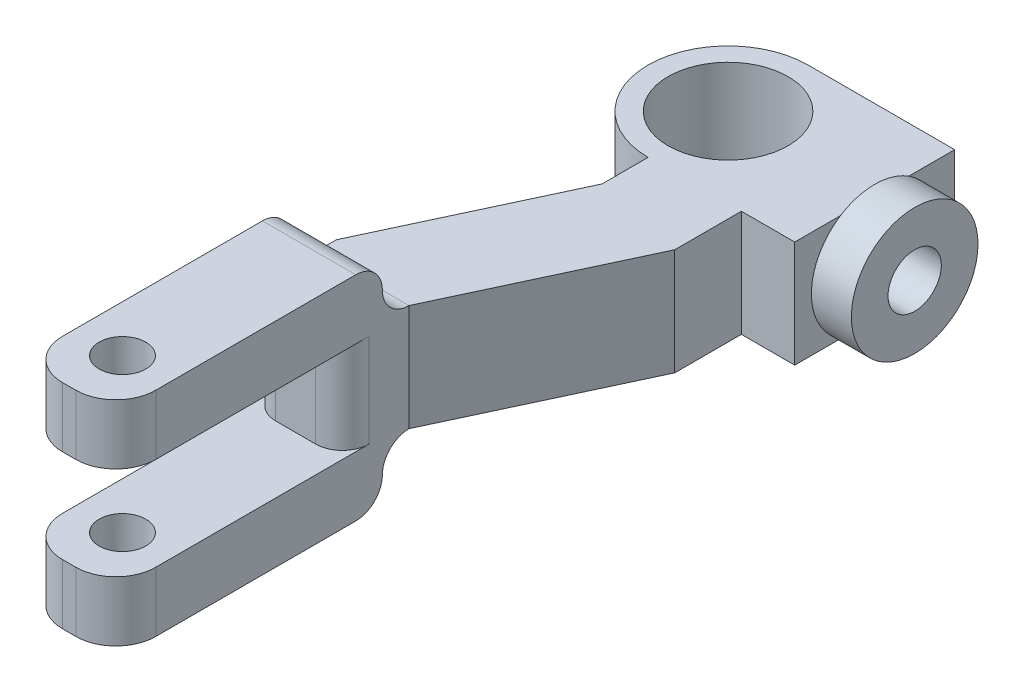
ISO-10303-21;
HEADER;
FILE_DESCRIPTION(('STEP AP214'),'2;1');
FILE_NAME('part.step','',(''),(''),'','','');
FILE_SCHEMA(('AUTOMOTIVE_DESIGN { 1 0 10303 214 1 1 1 1 }'));
ENDSEC;
DATA;
#1=APPLICATION_CONTEXT('core data for automotive mechanical design processes');
#2=APPLICATION_PROTOCOL_DEFINITION('international standard','automotive_design',2000,#1);
#3=PRODUCT_CONTEXT('',#1,'mechanical');
#4=PRODUCT('Part','Part','',(#3));
#5=PRODUCT_RELATED_PRODUCT_CATEGORY('part','',(#4));
#6=PRODUCT_DEFINITION_FORMATION('','',#4);
#7=PRODUCT_DEFINITION_CONTEXT('part definition',#1,'design');
#8=PRODUCT_DEFINITION('design','',#6,#7);
#9=PRODUCT_DEFINITION_SHAPE('','',#8);
#10=(LENGTH_UNIT() NAMED_UNIT(*) SI_UNIT(.MILLI.,.METRE.));
#11=(NAMED_UNIT(*) PLANE_ANGLE_UNIT() SI_UNIT($,.RADIAN.));
#12=(NAMED_UNIT(*) SI_UNIT($,.STERADIAN.) SOLID_ANGLE_UNIT());
#13=UNCERTAINTY_MEASURE_WITH_UNIT(LENGTH_MEASURE(1.E-05),#10,'distance_accuracy_value','');
#14=(GEOMETRIC_REPRESENTATION_CONTEXT(3) GLOBAL_UNCERTAINTY_ASSIGNED_CONTEXT((#13)) GLOBAL_UNIT_ASSIGNED_CONTEXT((#10,
#11,#12)) REPRESENTATION_CONTEXT('',''));
#15=CARTESIAN_POINT('',(0.,0.,0.));
#16=DIRECTION('',(0.,0.,1.));
#17=DIRECTION('',(1.,0.,0.));
#18=AXIS2_PLACEMENT_3D('',#15,#16,#17);
#19=CARTESIAN_POINT('',(0.,0.,46.5946168055497));
#20=DIRECTION('',(0.,0.,-1.));
#21=DIRECTION('',(-1.,0.,0.));
#22=AXIS2_PLACEMENT_3D('',#19,#20,#21);
#23=PLANE('',#22);
#24=DIRECTION('',(-1.,0.,0.));
#25=VECTOR('',#24,1.);
#26=CARTESIAN_POINT('',(0.660726073889497,12.,46.5946168055497));
#27=LINE('',#26,#25);
#28=CARTESIAN_POINT('',(-2.3392739261105,12.,46.5946168055497));
#29=VERTEX_POINT('',#28);
#30=CARTESIAN_POINT('',(-3.3392739261105,12.,46.5946168055497));
#31=VERTEX_POINT('',#30);
#32=EDGE_CURVE('E417',#29,#31,#27,.T.);
#33=ORIENTED_EDGE('',*,*,#32,.T.);
#34=DIRECTION('',(0.,-1.,0.));
#35=VECTOR('',#34,1.);
#36=CARTESIAN_POINT('',(-3.3392739261105,0.,46.5946168055497));
#37=LINE('',#36,#35);
#38=CARTESIAN_POINT('',(-3.3392739261105,7.5,46.5946168055497));
#39=VERTEX_POINT('',#38);
#40=EDGE_CURVE('E458',#31,#39,#37,.T.);
#41=ORIENTED_EDGE('',*,*,#40,.T.);
#42=DIRECTION('',(-1.,0.,0.));
#43=VECTOR('',#42,1.);
#44=CARTESIAN_POINT('',(-6.3392739261105,7.5,46.5946168055497));
#45=LINE('',#44,#43);
#46=CARTESIAN_POINT('',(-2.3392739261105,7.5,46.5946168055497));
#47=VERTEX_POINT('',#46);
#48=EDGE_CURVE('E573',#47,#39,#45,.T.);
#49=ORIENTED_EDGE('',*,*,#48,.F.);
#50=DIRECTION('',(0.,1.,0.));
#51=VECTOR('',#50,1.);
#52=CARTESIAN_POINT('',(-2.3392739261105,0.,46.5946168055497));
#53=LINE('',#52,#51);
#54=EDGE_CURVE('E454',#47,#29,#53,.T.);
#55=ORIENTED_EDGE('',*,*,#54,.T.);
#56=EDGE_LOOP('',(#33,#41,#49,#55));
#57=FACE_BOUND('',#56,.T.);
#58=ADVANCED_FACE('F43',(#57),#23,.F.);
#59=CARTESIAN_POINT('',(11.,8.,6.));
#60=DIRECTION('',(0.,0.,-1.));
#61=DIRECTION('',(-1.,0.,0.));
#62=AXIS2_PLACEMENT_3D('',#59,#60,#61);
#63=PLANE('',#62);
#64=DIRECTION('',(0.,-1.,0.));
#65=VECTOR('',#64,1.);
#66=CARTESIAN_POINT('',(7.,8.,6.));
#67=LINE('',#66,#65);
#68=CARTESIAN_POINT('',(7.,8.,6.));
#69=VERTEX_POINT('',#68);
#70=CARTESIAN_POINT('',(7.,0.,6.));
#71=VERTEX_POINT('',#70);
#72=EDGE_CURVE('E271',#69,#71,#67,.T.);
#73=ORIENTED_EDGE('',*,*,#72,.T.);
#74=DIRECTION('',(1.,0.,0.));
#75=VECTOR('',#74,1.);
#76=CARTESIAN_POINT('',(11.,0.,6.));
#77=LINE('',#76,#75);
#78=CARTESIAN_POINT('',(11.,0.,6.));
#79=VERTEX_POINT('',#78);
#80=EDGE_CURVE('E345',#71,#79,#77,.T.);
#81=ORIENTED_EDGE('',*,*,#80,.T.);
#82=DIRECTION('',(0.,-1.,0.));
#83=VECTOR('',#82,1.);
#84=CARTESIAN_POINT('',(11.,8.,6.));
#85=LINE('',#84,#83);
#86=CARTESIAN_POINT('',(11.,8.,6.));
#87=VERTEX_POINT('',#86);
#88=EDGE_CURVE('E363',#87,#79,#85,.T.);
#89=ORIENTED_EDGE('',*,*,#88,.F.);
#90=DIRECTION('',(1.,0.,0.));
#91=VECTOR('',#90,1.);
#92=CARTESIAN_POINT('',(11.,8.,6.));
#93=LINE('',#92,#91);
#94=EDGE_CURVE('E329',#69,#87,#93,.T.);
#95=ORIENTED_EDGE('',*,*,#94,.F.);
#96=EDGE_LOOP('',(#73,#81,#89,#95));
#97=FACE_BOUND('',#96,.T.);
#98=ADVANCED_FACE('F655',(#97),#63,.F.);
#99=CARTESIAN_POINT('',(11.,8.,-6.));
#100=DIRECTION('',(-1.,0.,0.));
#101=DIRECTION('',(0.,0.,1.));
#102=AXIS2_PLACEMENT_3D('',#99,#100,#101);
#103=PLANE('',#102);
#104=CARTESIAN_POINT('',(11.,4.,0.));
#105=DIRECTION('',(1.,0.,0.));
#106=DIRECTION('',(0.,0.,-1.));
#107=AXIS2_PLACEMENT_3D('',#104,#105,#106);
#108=CIRCLE('',#107,4.75);
#109=CARTESIAN_POINT('',(11.,8.,2.5617376914899));
#110=VERTEX_POINT('',#109);
#111=CARTESIAN_POINT('',(11.,0.,2.5617376914899));
#112=VERTEX_POINT('',#111);
#113=EDGE_CURVE('E375',#110,#112,#108,.T.);
#114=ORIENTED_EDGE('',*,*,#113,.F.);
#115=DIRECTION('',(0.,0.,-1.));
#116=VECTOR('',#115,1.);
#117=CARTESIAN_POINT('',(11.,8.,-6.));
#118=LINE('',#117,#116);
#119=EDGE_CURVE('E334',#87,#110,#118,.T.);
#120=ORIENTED_EDGE('',*,*,#119,.F.);
#121=ORIENTED_EDGE('',*,*,#88,.T.);
#122=DIRECTION('',(0.,0.,-1.));
#123=VECTOR('',#122,1.);
#124=CARTESIAN_POINT('',(11.,0.,-6.));
#125=LINE('',#124,#123);
#126=EDGE_CURVE('E349',#79,#112,#125,.T.);
#127=ORIENTED_EDGE('',*,*,#126,.T.);
#128=EDGE_LOOP('',(#114,#120,#121,#127));
#129=FACE_BOUND('',#128,.T.);
#130=ADVANCED_FACE('F660',(#129),#103,.F.);
#131=CARTESIAN_POINT('',(0.,8.,0.));
#132=DIRECTION('',(0.,1.,0.));
#133=DIRECTION('',(0.,0.,1.));
#134=AXIS2_PLACEMENT_3D('',#131,#132,#133);
#135=PLANE('',#134);
#136=DIRECTION('',(0.,0.,1.));
#137=VECTOR('',#136,1.);
#138=CARTESIAN_POINT('',(-6.3392739261105,8.,23.0427541670492));
#139=LINE('',#138,#137);
#140=CARTESIAN_POINT('',(-6.3392739261105,8.,23.0427541670492));
#141=VERTEX_POINT('',#140);
#142=CARTESIAN_POINT('',(-6.3392739261105,8.,24.5946168055497));
#143=VERTEX_POINT('',#142);
#144=EDGE_CURVE('E258',#141,#143,#139,.T.);
#145=ORIENTED_EDGE('',*,*,#144,.T.);
#146=DIRECTION('',(1.,0.,0.));
#147=VECTOR('',#146,1.);
#148=CARTESIAN_POINT('',(0.660726073889498,8.,24.5946168055497));
#149=LINE('',#148,#147);
#150=CARTESIAN_POINT('',(0.660726073889498,8.,24.5946168055497));
#151=VERTEX_POINT('',#150);
#152=EDGE_CURVE('E392',#143,#151,#149,.T.);
#153=ORIENTED_EDGE('',*,*,#152,.T.);
#154=DIRECTION('',(0.4226182617407,0.,-0.90630778703665));
#155=VECTOR('',#154,1.);
#156=CARTESIAN_POINT('',(0.660726073889498,8.,24.5946168055497));
#157=LINE('',#156,#155);
#158=CARTESIAN_POINT('',(7.,8.,11.));
#159=VERTEX_POINT('',#158);
#160=EDGE_CURVE('E261',#151,#159,#157,.T.);
#161=ORIENTED_EDGE('',*,*,#160,.T.);
#162=DIRECTION('',(0.,0.,-1.));
#163=VECTOR('',#162,1.);
#164=CARTESIAN_POINT('',(7.,8.,11.));
#165=LINE('',#164,#163);
#166=EDGE_CURVE('E267',#159,#69,#165,.T.);
#167=ORIENTED_EDGE('',*,*,#166,.T.);
#168=ORIENTED_EDGE('',*,*,#94,.T.);
#169=ORIENTED_EDGE('',*,*,#119,.T.);
#170=CARTESIAN_POINT('',(11.,8.,-2.5617376914899));
#171=VERTEX_POINT('',#170);
#172=EDGE_CURVE('E339',#110,#171,#118,.T.);
#173=ORIENTED_EDGE('',*,*,#172,.T.);
#174=CARTESIAN_POINT('',(11.,8.,-6.));
#175=VERTEX_POINT('',#174);
#176=EDGE_CURVE('E333',#171,#175,#118,.T.);
#177=ORIENTED_EDGE('',*,*,#176,.T.);
#178=DIRECTION('',(-1.,0.,0.));
#179=VECTOR('',#178,1.);
#180=CARTESIAN_POINT('',(0.,8.,-6.));
#181=LINE('',#180,#179);
#182=CARTESIAN_POINT('',(0.,8.,-6.));
#183=VERTEX_POINT('',#182);
#184=EDGE_CURVE('E338',#175,#183,#181,.T.);
#185=ORIENTED_EDGE('',*,*,#184,.T.);
#186=CARTESIAN_POINT('',(0.,8.,0.));
#187=DIRECTION('',(0.,1.,0.));
#188=DIRECTION('',(0.,0.,1.));
#189=AXIS2_PLACEMENT_3D('',#186,#187,#188);
#190=CIRCLE('',#189,6.);
#191=CARTESIAN_POINT('',(0.,8.,6.));
#192=VERTEX_POINT('',#191);
#193=EDGE_CURVE('E236',#183,#192,#190,.T.);
#194=ORIENTED_EDGE('',*,*,#193,.T.);
#195=DIRECTION('',(0.,0.,1.));
#196=VECTOR('',#195,1.);
#197=CARTESIAN_POINT('',(0.,8.,6.));
#198=LINE('',#197,#196);
#199=CARTESIAN_POINT('',(0.,8.,9.44813736149942));
#200=VERTEX_POINT('',#199);
#201=EDGE_CURVE('E227',#192,#200,#198,.T.);
#202=ORIENTED_EDGE('',*,*,#201,.T.);
#203=DIRECTION('',(-0.4226182617407,0.,0.90630778703665));
#204=VECTOR('',#203,1.);
#205=CARTESIAN_POINT('',(0.,8.,9.44813736149942));
#206=LINE('',#205,#204);
#207=EDGE_CURVE('E233',#200,#141,#206,.T.);
#208=ORIENTED_EDGE('',*,*,#207,.T.);
#209=EDGE_LOOP('',(#145,#153,#161,#167,#168,#169,#173,#177,#185,#194,#202,#208));
#210=FACE_BOUND('',#209,.T.);
#211=CARTESIAN_POINT('',(0.,8.,0.));
#212=DIRECTION('',(0.,1.,0.));
#213=DIRECTION('',(0.,0.,1.));
#214=AXIS2_PLACEMENT_3D('',#211,#212,#213);
#215=CIRCLE('',#214,4.5);
#216=CARTESIAN_POINT('',(0.,8.,4.5));
#217=VERTEX_POINT('',#216);
#218=EDGE_CURVE('E319',#217,#217,#215,.T.);
#219=ORIENTED_EDGE('',*,*,#218,.F.);
#220=EDGE_LOOP('',(#219));
#221=FACE_BOUND('',#220,.T.);
#222=ADVANCED_FACE('F230',(#210,#221),#135,.T.);
#223=CARTESIAN_POINT('',(0.,0.,0.));
#224=DIRECTION('',(0.,1.,0.));
#225=DIRECTION('',(0.,0.,1.));
#226=AXIS2_PLACEMENT_3D('',#223,#224,#225);
#227=PLANE('',#226);
#228=DIRECTION('',(0.4226182617407,0.,-0.90630778703665));
#229=VECTOR('',#228,1.);
#230=CARTESIAN_POINT('',(0.660726073889498,0.,24.5946168055497));
#231=LINE('',#230,#229);
#232=CARTESIAN_POINT('',(0.660726073889498,0.,24.5946168055497));
#233=VERTEX_POINT('',#232);
#234=CARTESIAN_POINT('',(7.,0.,11.));
#235=VERTEX_POINT('',#234);
#236=EDGE_CURVE('E282',#233,#235,#231,.T.);
#237=ORIENTED_EDGE('',*,*,#236,.F.);
#238=DIRECTION('',(1.,0.,0.));
#239=VECTOR('',#238,1.);
#240=CARTESIAN_POINT('',(0.,0.,24.5946168055497));
#241=LINE('',#240,#239);
#242=CARTESIAN_POINT('',(-6.3392739261105,0.,24.5946168055497));
#243=VERTEX_POINT('',#242);
#244=EDGE_CURVE('E389',#233,#243,#241,.F.);
#245=ORIENTED_EDGE('',*,*,#244,.T.);
#246=DIRECTION('',(0.,0.,1.));
#247=VECTOR('',#246,1.);
#248=CARTESIAN_POINT('',(-6.3392739261105,0.,23.0427541670492));
#249=LINE('',#248,#247);
#250=CARTESIAN_POINT('',(-6.3392739261105,0.,23.0427541670492));
#251=VERTEX_POINT('',#250);
#252=EDGE_CURVE('E278',#251,#243,#249,.T.);
#253=ORIENTED_EDGE('',*,*,#252,.F.);
#254=DIRECTION('',(-0.4226182617407,0.,0.90630778703665));
#255=VECTOR('',#254,1.);
#256=CARTESIAN_POINT('',(0.,0.,9.44813736149942));
#257=LINE('',#256,#255);
#258=CARTESIAN_POINT('',(0.,0.,9.44813736149942));
#259=VERTEX_POINT('',#258);
#260=EDGE_CURVE('E274',#259,#251,#257,.T.);
#261=ORIENTED_EDGE('',*,*,#260,.F.);
#262=DIRECTION('',(0.,0.,1.));
#263=VECTOR('',#262,1.);
#264=CARTESIAN_POINT('',(0.,0.,6.));
#265=LINE('',#264,#263);
#266=CARTESIAN_POINT('',(0.,0.,6.));
#267=VERTEX_POINT('',#266);
#268=EDGE_CURVE('E247',#267,#259,#265,.T.);
#269=ORIENTED_EDGE('',*,*,#268,.F.);
#270=CARTESIAN_POINT('',(0.,0.,0.));
#271=DIRECTION('',(0.,1.,0.));
#272=DIRECTION('',(0.,0.,1.));
#273=AXIS2_PLACEMENT_3D('',#270,#271,#272);
#274=CIRCLE('',#273,6.);
#275=CARTESIAN_POINT('',(0.,0.,-6.));
#276=VERTEX_POINT('',#275);
#277=EDGE_CURVE('E323',#276,#267,#274,.T.);
#278=ORIENTED_EDGE('',*,*,#277,.F.);
#279=DIRECTION('',(-1.,0.,0.));
#280=VECTOR('',#279,1.);
#281=CARTESIAN_POINT('',(0.,0.,-6.));
#282=LINE('',#281,#280);
#283=CARTESIAN_POINT('',(11.,0.,-6.));
#284=VERTEX_POINT('',#283);
#285=EDGE_CURVE('E330',#284,#276,#282,.T.);
#286=ORIENTED_EDGE('',*,*,#285,.F.);
#287=CARTESIAN_POINT('',(11.,0.,-2.5617376914899));
#288=VERTEX_POINT('',#287);
#289=EDGE_CURVE('E348',#288,#284,#125,.T.);
#290=ORIENTED_EDGE('',*,*,#289,.F.);
#291=EDGE_CURVE('E353',#112,#288,#125,.T.);
#292=ORIENTED_EDGE('',*,*,#291,.F.);
#293=ORIENTED_EDGE('',*,*,#126,.F.);
#294=ORIENTED_EDGE('',*,*,#80,.F.);
#295=DIRECTION('',(0.,0.,-1.));
#296=VECTOR('',#295,1.);
#297=CARTESIAN_POINT('',(7.,0.,11.));
#298=LINE('',#297,#296);
#299=EDGE_CURVE('E241',#235,#71,#298,.T.);
#300=ORIENTED_EDGE('',*,*,#299,.F.);
#301=EDGE_LOOP('',(#237,#245,#253,#261,#269,#278,#286,#290,#292,#293,#294,#300));
#302=FACE_BOUND('',#301,.T.);
#303=CARTESIAN_POINT('',(0.,0.,0.));
#304=DIRECTION('',(0.,1.,0.));
#305=DIRECTION('',(0.,0.,1.));
#306=AXIS2_PLACEMENT_3D('',#303,#304,#305);
#307=CIRCLE('',#306,4.5);
#308=CARTESIAN_POINT('',(0.,0.,4.5));
#309=VERTEX_POINT('',#308);
#310=EDGE_CURVE('E313',#309,#309,#307,.T.);
#311=ORIENTED_EDGE('',*,*,#310,.T.);
#312=EDGE_LOOP('',(#311));
#313=FACE_BOUND('',#312,.T.);
#314=ADVANCED_FACE('F638',(#302,#313),#227,.F.);
#315=CARTESIAN_POINT('',(0.,8.,0.));
#316=DIRECTION('',(0.,-1.,0.));
#317=DIRECTION('',(0.,0.,-1.));
#318=AXIS2_PLACEMENT_3D('',#315,#316,#317);
#319=CYLINDRICAL_SURFACE('',#318,6.);
#320=ORIENTED_EDGE('',*,*,#277,.T.);
#321=DIRECTION('',(0.,-1.,0.));
#322=VECTOR('',#321,1.);
#323=CARTESIAN_POINT('',(0.,8.,6.));
#324=LINE('',#323,#322);
#325=EDGE_CURVE('E367',#192,#267,#324,.T.);
#326=ORIENTED_EDGE('',*,*,#325,.F.);
#327=ORIENTED_EDGE('',*,*,#193,.F.);
#328=DIRECTION('',(0.,-1.,0.));
#329=VECTOR('',#328,1.);
#330=CARTESIAN_POINT('',(0.,8.,-6.));
#331=LINE('',#330,#329);
#332=EDGE_CURVE('E342',#183,#276,#331,.T.);
#333=ORIENTED_EDGE('',*,*,#332,.T.);
#334=EDGE_LOOP('',(#320,#326,#327,#333));
#335=FACE_BOUND('',#334,.T.);
#336=ADVANCED_FACE('F721',(#335),#319,.T.);
#337=EDGE_CURVE('E318',#288,#171,#108,.T.);
#338=ORIENTED_EDGE('',*,*,#337,.F.);
#339=ORIENTED_EDGE('',*,*,#289,.T.);
#340=DIRECTION('',(0.,-1.,0.));
#341=VECTOR('',#340,1.);
#342=CARTESIAN_POINT('',(11.,8.,-6.));
#343=LINE('',#342,#341);
#344=EDGE_CURVE('E359',#175,#284,#343,.T.);
#345=ORIENTED_EDGE('',*,*,#344,.F.);
#346=ORIENTED_EDGE('',*,*,#176,.F.);
#347=EDGE_LOOP('',(#338,#339,#345,#346));
#348=FACE_BOUND('',#347,.T.);
#349=ADVANCED_FACE('F724',(#348),#103,.F.);
#350=CARTESIAN_POINT('',(0.,8.,-6.));
#351=DIRECTION('',(0.,0.,1.));
#352=DIRECTION('',(1.,0.,0.));
#353=AXIS2_PLACEMENT_3D('',#350,#351,#352);
#354=PLANE('',#353);
#355=ORIENTED_EDGE('',*,*,#285,.T.);
#356=ORIENTED_EDGE('',*,*,#332,.F.);
#357=ORIENTED_EDGE('',*,*,#184,.F.);
#358=ORIENTED_EDGE('',*,*,#344,.T.);
#359=EDGE_LOOP('',(#355,#356,#357,#358));
#360=FACE_BOUND('',#359,.T.);
#361=ADVANCED_FACE('F715',(#360),#354,.F.);
#362=CARTESIAN_POINT('',(0.,8.,0.));
#363=DIRECTION('',(0.,-1.,0.));
#364=DIRECTION('',(0.,0.,-1.));
#365=AXIS2_PLACEMENT_3D('',#362,#363,#364);
#366=CYLINDRICAL_SURFACE('',#365,4.5);
#367=ORIENTED_EDGE('',*,*,#218,.T.);
#368=EDGE_LOOP('',(#367));
#369=FACE_BOUND('',#368,.T.);
#370=ORIENTED_EDGE('',*,*,#310,.F.);
#371=EDGE_LOOP('',(#370));
#372=FACE_BOUND('',#371,.T.);
#373=ADVANCED_FACE('F712',(#369,#372),#366,.F.);
#374=CARTESIAN_POINT('',(11.,4.,0.));
#375=DIRECTION('',(1.,0.,0.));
#376=DIRECTION('',(0.,0.,-1.));
#377=AXIS2_PLACEMENT_3D('',#374,#375,#376);
#378=PLANE('',#377);
#379=EDGE_CURVE('E305',#112,#288,#108,.T.);
#380=ORIENTED_EDGE('',*,*,#379,.F.);
#381=ORIENTED_EDGE('',*,*,#291,.T.);
#382=EDGE_LOOP('',(#380,#381));
#383=FACE_BOUND('',#382,.T.);
#384=ADVANCED_FACE('F708',(#383),#378,.F.);
#385=CARTESIAN_POINT('',(14.,4.,0.));
#386=DIRECTION('',(-1.,0.,0.));
#387=DIRECTION('',(0.,0.,1.));
#388=AXIS2_PLACEMENT_3D('',#385,#386,#387);
#389=CYLINDRICAL_SURFACE('',#388,4.75);
#390=CARTESIAN_POINT('',(14.,4.,0.));
#391=DIRECTION('',(1.,0.,0.));
#392=DIRECTION('',(0.,0.,-1.));
#393=AXIS2_PLACEMENT_3D('',#390,#391,#392);
#394=CIRCLE('',#393,4.75);
#395=CARTESIAN_POINT('',(14.,4.,-4.75));
#396=VERTEX_POINT('',#395);
#397=EDGE_CURVE('E309',#396,#396,#394,.T.);
#398=ORIENTED_EDGE('',*,*,#397,.F.);
#399=EDGE_LOOP('',(#398));
#400=FACE_BOUND('',#399,.T.);
#401=EDGE_CURVE('E314',#171,#110,#108,.T.);
#402=ORIENTED_EDGE('',*,*,#401,.T.);
#403=ORIENTED_EDGE('',*,*,#113,.T.);
#404=ORIENTED_EDGE('',*,*,#379,.T.);
#405=ORIENTED_EDGE('',*,*,#337,.T.);
#406=EDGE_LOOP('',(#402,#403,#404,#405));
#407=FACE_BOUND('',#406,.T.);
#408=ADVANCED_FACE('F703',(#400,#407),#389,.T.);
#409=CARTESIAN_POINT('',(14.,4.,0.));
#410=DIRECTION('',(1.,0.,0.));
#411=DIRECTION('',(0.,0.,-1.));
#412=AXIS2_PLACEMENT_3D('',#409,#410,#411);
#413=PLANE('',#412);
#414=CARTESIAN_POINT('',(14.,4.,0.));
#415=DIRECTION('',(1.,0.,0.));
#416=DIRECTION('',(0.,0.,-1.));
#417=AXIS2_PLACEMENT_3D('',#414,#415,#416);
#418=CIRCLE('',#417,2.);
#419=CARTESIAN_POINT('',(14.,4.,-2.));
#420=VERTEX_POINT('',#419);
#421=EDGE_CURVE('E251',#420,#420,#418,.T.);
#422=ORIENTED_EDGE('',*,*,#421,.F.);
#423=EDGE_LOOP('',(#422));
#424=FACE_BOUND('',#423,.T.);
#425=ORIENTED_EDGE('',*,*,#397,.T.);
#426=EDGE_LOOP('',(#425));
#427=FACE_BOUND('',#426,.T.);
#428=ADVANCED_FACE('F700',(#424,#427),#413,.T.);
#429=ORIENTED_EDGE('',*,*,#172,.F.);
#430=ORIENTED_EDGE('',*,*,#401,.F.);
#431=EDGE_LOOP('',(#429,#430));
#432=FACE_BOUND('',#431,.T.);
#433=ADVANCED_FACE('F698',(#432),#378,.F.);
#434=CARTESIAN_POINT('',(9.,4.,0.));
#435=DIRECTION('',(1.,0.,0.));
#436=DIRECTION('',(0.,0.,-1.));
#437=AXIS2_PLACEMENT_3D('',#434,#435,#436);
#438=CYLINDRICAL_SURFACE('',#437,2.);
#439=CARTESIAN_POINT('',(9.,4.,0.));
#440=DIRECTION('',(1.,0.,0.));
#441=DIRECTION('',(0.,0.,-1.));
#442=AXIS2_PLACEMENT_3D('',#439,#440,#441);
#443=CIRCLE('',#442,2.);
#444=CARTESIAN_POINT('',(9.,4.,-2.));
#445=VERTEX_POINT('',#444);
#446=EDGE_CURVE('E301',#445,#445,#443,.T.);
#447=ORIENTED_EDGE('',*,*,#446,.F.);
#448=EDGE_LOOP('',(#447));
#449=FACE_BOUND('',#448,.T.);
#450=ORIENTED_EDGE('',*,*,#421,.T.);
#451=EDGE_LOOP('',(#450));
#452=FACE_BOUND('',#451,.T.);
#453=ADVANCED_FACE('F694',(#449,#452),#438,.F.);
#454=CARTESIAN_POINT('',(9.,4.,0.));
#455=DIRECTION('',(1.,0.,0.));
#456=DIRECTION('',(0.,0.,-1.));
#457=AXIS2_PLACEMENT_3D('',#454,#455,#456);
#458=PLANE('',#457);
#459=ORIENTED_EDGE('',*,*,#446,.T.);
#460=EDGE_LOOP('',(#459));
#461=FACE_BOUND('',#460,.T.);
#462=ADVANCED_FACE('F691',(#461),#458,.T.);
#463=CARTESIAN_POINT('',(0.,8.,6.));
#464=DIRECTION('',(1.,0.,0.));
#465=DIRECTION('',(0.,0.,-1.));
#466=AXIS2_PLACEMENT_3D('',#463,#464,#465);
#467=PLANE('',#466);
#468=ORIENTED_EDGE('',*,*,#268,.T.);
#469=DIRECTION('',(0.,-1.,0.));
#470=VECTOR('',#469,1.);
#471=CARTESIAN_POINT('',(0.,8.,9.44813736149942));
#472=LINE('',#471,#470);
#473=EDGE_CURVE('E244',#200,#259,#472,.T.);
#474=ORIENTED_EDGE('',*,*,#473,.F.);
#475=ORIENTED_EDGE('',*,*,#201,.F.);
#476=ORIENTED_EDGE('',*,*,#325,.T.);
#477=EDGE_LOOP('',(#468,#474,#475,#476));
#478=FACE_BOUND('',#477,.T.);
#479=ADVANCED_FACE('F245',(#478),#467,.F.);
#480=CARTESIAN_POINT('',(0.,8.,9.44813736149942));
#481=DIRECTION('',(0.90630778703665,0.,0.4226182617407));
#482=DIRECTION('',(0.4226182617407,0.,-0.90630778703665));
#483=AXIS2_PLACEMENT_3D('',#480,#481,#482);
#484=PLANE('',#483);
#485=ORIENTED_EDGE('',*,*,#260,.T.);
#486=DIRECTION('',(0.,-1.,0.));
#487=VECTOR('',#486,1.);
#488=CARTESIAN_POINT('',(-6.3392739261105,8.,23.0427541670492));
#489=LINE('',#488,#487);
#490=EDGE_CURVE('E252',#141,#251,#489,.T.);
#491=ORIENTED_EDGE('',*,*,#490,.F.);
#492=ORIENTED_EDGE('',*,*,#207,.F.);
#493=ORIENTED_EDGE('',*,*,#473,.T.);
#494=EDGE_LOOP('',(#485,#491,#492,#493));
#495=FACE_BOUND('',#494,.T.);
#496=ADVANCED_FACE('F254',(#495),#484,.F.);
#497=CARTESIAN_POINT('',(-6.3392739261105,8.,23.0427541670492));
#498=DIRECTION('',(1.,0.,0.));
#499=DIRECTION('',(0.,0.,-1.));
#500=AXIS2_PLACEMENT_3D('',#497,#498,#499);
#501=PLANE('',#500);
#502=DIRECTION('',(0.,0.,1.));
#503=VECTOR('',#502,1.);
#504=CARTESIAN_POINT('',(-6.3392739261105,0.499999999999998,29.5946168055497));
#505=LINE('',#504,#503);
#506=CARTESIAN_POINT('',(-6.3392739261105,0.499999999999998,27.5946168055497));
#507=VERTEX_POINT('',#506);
#508=CARTESIAN_POINT('',(-6.3392739261105,0.499999999999998,43.5946168055497));
#509=VERTEX_POINT('',#508);
#510=EDGE_CURVE('E517',#507,#509,#505,.T.);
#511=ORIENTED_EDGE('',*,*,#510,.F.);
#512=DIRECTION('',(0.,-1.,0.));
#513=VECTOR('',#512,1.);
#514=CARTESIAN_POINT('',(-6.3392739261105,7.5,27.5946168055497));
#515=LINE('',#514,#513);
#516=CARTESIAN_POINT('',(-6.3392739261105,7.5,27.5946168055497));
#517=VERTEX_POINT('',#516);
#518=EDGE_CURVE('E488',#507,#517,#515,.F.);
#519=ORIENTED_EDGE('',*,*,#518,.T.);
#520=DIRECTION('',(0.,0.,1.));
#521=VECTOR('',#520,1.);
#522=CARTESIAN_POINT('',(-6.3392739261105,7.5,29.5946168055497));
#523=LINE('',#522,#521);
#524=CARTESIAN_POINT('',(-6.3392739261105,7.5,43.5946168055497));
#525=VERTEX_POINT('',#524);
#526=EDGE_CURVE('E422',#517,#525,#523,.T.);
#527=ORIENTED_EDGE('',*,*,#526,.T.);
#528=DIRECTION('',(0.,-1.,0.));
#529=VECTOR('',#528,1.);
#530=CARTESIAN_POINT('',(-6.3392739261105,8.,43.5946168055497));
#531=LINE('',#530,#529);
#532=CARTESIAN_POINT('',(-6.3392739261105,12.,43.5946168055497));
#533=VERTEX_POINT('',#532);
#534=EDGE_CURVE('E448',#525,#533,#531,.F.);
#535=ORIENTED_EDGE('',*,*,#534,.T.);
#536=DIRECTION('',(0.,0.,-1.));
#537=VECTOR('',#536,1.);
#538=CARTESIAN_POINT('',(-6.3392739261105,12.,46.5946168055497));
#539=LINE('',#538,#537);
#540=CARTESIAN_POINT('',(-6.3392739261105,12.,28.5946168055497));
#541=VERTEX_POINT('',#540);
#542=EDGE_CURVE('E546',#533,#541,#539,.T.);
#543=ORIENTED_EDGE('',*,*,#542,.T.);
#544=CARTESIAN_POINT('',(-6.3392739261105,10.,28.5946168055497));
#545=DIRECTION('',(1.,0.,0.));
#546=DIRECTION('',(0.,0.,-1.));
#547=AXIS2_PLACEMENT_3D('',#544,#545,#546);
#548=CIRCLE('',#547,2.);
#549=CARTESIAN_POINT('',(-6.3392739261105,10.,26.5946168055497));
#550=VERTEX_POINT('',#549);
#551=EDGE_CURVE('E382',#541,#550,#548,.F.);
#552=ORIENTED_EDGE('',*,*,#551,.T.);
#553=CARTESIAN_POINT('',(-6.3392739261105,10.,24.5946168055497));
#554=DIRECTION('',(1.,0.,0.));
#555=DIRECTION('',(0.,0.,-1.));
#556=AXIS2_PLACEMENT_3D('',#553,#554,#555);
#557=CIRCLE('',#556,2.);
#558=EDGE_CURVE('E409',#550,#143,#557,.T.);
#559=ORIENTED_EDGE('',*,*,#558,.T.);
#560=ORIENTED_EDGE('',*,*,#144,.F.);
#561=ORIENTED_EDGE('',*,*,#490,.T.);
#562=ORIENTED_EDGE('',*,*,#252,.T.);
#563=CARTESIAN_POINT('',(-6.3392739261105,-2.,24.5946168055497));
#564=DIRECTION('',(1.,0.,0.));
#565=DIRECTION('',(0.,0.,-1.));
#566=AXIS2_PLACEMENT_3D('',#563,#564,#565);
#567=CIRCLE('',#566,2.);
#568=CARTESIAN_POINT('',(-6.3392739261105,-2.,26.5946168055497));
#569=VERTEX_POINT('',#568);
#570=EDGE_CURVE('E403',#243,#569,#567,.T.);
#571=ORIENTED_EDGE('',*,*,#570,.T.);
#572=CARTESIAN_POINT('',(-6.3392739261105,-2.,28.5946168055497));
#573=DIRECTION('',(1.,0.,0.));
#574=DIRECTION('',(0.,0.,-1.));
#575=AXIS2_PLACEMENT_3D('',#572,#573,#574);
#576=CIRCLE('',#575,2.);
#577=CARTESIAN_POINT('',(-6.3392739261105,-4.,28.5946168055497));
#578=VERTEX_POINT('',#577);
#579=EDGE_CURVE('E385',#569,#578,#576,.F.);
#580=ORIENTED_EDGE('',*,*,#579,.T.);
#581=DIRECTION('',(0.,0.,-1.));
#582=VECTOR('',#581,1.);
#583=CARTESIAN_POINT('',(-6.3392739261105,-4.,46.5946168055497));
#584=LINE('',#583,#582);
#585=CARTESIAN_POINT('',(-6.3392739261105,-4.,43.5946168055497));
#586=VERTEX_POINT('',#585);
#587=EDGE_CURVE('E538',#586,#578,#584,.T.);
#588=ORIENTED_EDGE('',*,*,#587,.F.);
#589=DIRECTION('',(0.,-1.,0.));
#590=VECTOR('',#589,1.);
#591=CARTESIAN_POINT('',(-6.3392739261105,8.,43.5946168055497));
#592=LINE('',#591,#590);
#593=EDGE_CURVE('E451',#586,#509,#592,.F.);
#594=ORIENTED_EDGE('',*,*,#593,.T.);
#595=EDGE_LOOP('',(#511,#519,#527,#535,#543,#552,#559,#560,#561,#562,#571,#580,#588,#594));
#596=FACE_BOUND('',#595,.T.);
#597=ADVANCED_FACE('F564',(#596),#501,.F.);
#598=CARTESIAN_POINT('',(0.660726073889498,8.,26.5946168055497));
#599=DIRECTION('',(-1.,0.,0.));
#600=DIRECTION('',(0.,0.,1.));
#601=AXIS2_PLACEMENT_3D('',#598,#599,#600);
#602=PLANE('',#601);
#603=DIRECTION('',(0.,0.,1.));
#604=VECTOR('',#603,1.);
#605=CARTESIAN_POINT('',(0.660726073889498,7.5,29.5946168055497));
#606=LINE('',#605,#604);
#607=CARTESIAN_POINT('',(0.660726073889498,7.5,27.5946168055497));
#608=VERTEX_POINT('',#607);
#609=CARTESIAN_POINT('',(0.660726073889498,7.5,43.5946168055497));
#610=VERTEX_POINT('',#609);
#611=EDGE_CURVE('E59',#608,#610,#606,.T.);
#612=ORIENTED_EDGE('',*,*,#611,.F.);
#613=DIRECTION('',(0.,1.,0.));
#614=VECTOR('',#613,1.);
#615=CARTESIAN_POINT('',(0.660726073889498,0.499999999999998,27.5946168055497));
#616=LINE('',#615,#614);
#617=CARTESIAN_POINT('',(0.660726073889499,0.499999999999998,27.5946168055497));
#618=VERTEX_POINT('',#617);
#619=EDGE_CURVE('E492',#608,#618,#616,.F.);
#620=ORIENTED_EDGE('',*,*,#619,.T.);
#621=DIRECTION('',(0.,0.,1.));
#622=VECTOR('',#621,1.);
#623=CARTESIAN_POINT('',(0.660726073889499,0.499999999999998,29.5946168055497));
#624=LINE('',#623,#622);
#625=CARTESIAN_POINT('',(0.660726073889499,0.499999999999998,43.5946168055497));
#626=VERTEX_POINT('',#625);
#627=EDGE_CURVE('E66',#618,#626,#624,.T.);
#628=ORIENTED_EDGE('',*,*,#627,.T.);
#629=DIRECTION('',(0.,1.,0.));
#630=VECTOR('',#629,1.);
#631=CARTESIAN_POINT('',(0.660726073889498,8.,43.5946168055497));
#632=LINE('',#631,#630);
#633=CARTESIAN_POINT('',(0.660726073889499,-4.,43.5946168055497));
#634=VERTEX_POINT('',#633);
#635=EDGE_CURVE('E439',#626,#634,#632,.F.);
#636=ORIENTED_EDGE('',*,*,#635,.T.);
#637=DIRECTION('',(0.,0.,-1.));
#638=VECTOR('',#637,1.);
#639=CARTESIAN_POINT('',(0.660726073889499,-4.,46.5946168055497));
#640=LINE('',#639,#638);
#641=CARTESIAN_POINT('',(0.660726073889499,-4.,28.5946168055497));
#642=VERTEX_POINT('',#641);
#643=EDGE_CURVE('E528',#634,#642,#640,.T.);
#644=ORIENTED_EDGE('',*,*,#643,.T.);
#645=CARTESIAN_POINT('',(0.660726073889498,-2.,28.5946168055497));
#646=DIRECTION('',(-1.,0.,0.));
#647=DIRECTION('',(0.,0.,1.));
#648=AXIS2_PLACEMENT_3D('',#645,#646,#647);
#649=CIRCLE('',#648,2.);
#650=CARTESIAN_POINT('',(0.660726073889499,-2.,26.5946168055497));
#651=VERTEX_POINT('',#650);
#652=EDGE_CURVE('E379',#642,#651,#649,.F.);
#653=ORIENTED_EDGE('',*,*,#652,.T.);
#654=CARTESIAN_POINT('',(0.660726073889498,-2.,24.5946168055497));
#655=DIRECTION('',(-1.,0.,0.));
#656=DIRECTION('',(0.,0.,1.));
#657=AXIS2_PLACEMENT_3D('',#654,#655,#656);
#658=CIRCLE('',#657,2.);
#659=EDGE_CURVE('E400',#651,#233,#658,.T.);
#660=ORIENTED_EDGE('',*,*,#659,.T.);
#661=DIRECTION('',(0.,-1.,0.));
#662=VECTOR('',#661,1.);
#663=CARTESIAN_POINT('',(0.660726073889498,8.,24.5946168055497));
#664=LINE('',#663,#662);
#665=EDGE_CURVE('E295',#151,#233,#664,.T.);
#666=ORIENTED_EDGE('',*,*,#665,.F.);
#667=CARTESIAN_POINT('',(0.660726073889498,10.,24.5946168055497));
#668=DIRECTION('',(-1.,0.,0.));
#669=DIRECTION('',(0.,0.,1.));
#670=AXIS2_PLACEMENT_3D('',#667,#668,#669);
#671=CIRCLE('',#670,2.);
#672=CARTESIAN_POINT('',(0.660726073889498,10.,26.5946168055497));
#673=VERTEX_POINT('',#672);
#674=EDGE_CURVE('E406',#151,#673,#671,.T.);
#675=ORIENTED_EDGE('',*,*,#674,.T.);
#676=CARTESIAN_POINT('',(0.660726073889498,10.,28.5946168055497));
#677=DIRECTION('',(-1.,0.,0.));
#678=DIRECTION('',(0.,0.,1.));
#679=AXIS2_PLACEMENT_3D('',#676,#677,#678);
#680=CIRCLE('',#679,2.);
#681=CARTESIAN_POINT('',(0.660726073889497,12.,28.5946168055497));
#682=VERTEX_POINT('',#681);
#683=EDGE_CURVE('E374',#673,#682,#680,.F.);
#684=ORIENTED_EDGE('',*,*,#683,.T.);
#685=DIRECTION('',(0.,0.,-1.));
#686=VECTOR('',#685,1.);
#687=CARTESIAN_POINT('',(0.660726073889497,12.,46.5946168055497));
#688=LINE('',#687,#686);
#689=CARTESIAN_POINT('',(0.660726073889497,12.,43.5946168055497));
#690=VERTEX_POINT('',#689);
#691=EDGE_CURVE('E275',#690,#682,#688,.T.);
#692=ORIENTED_EDGE('',*,*,#691,.F.);
#693=DIRECTION('',(0.,1.,0.));
#694=VECTOR('',#693,1.);
#695=CARTESIAN_POINT('',(0.660726073889498,8.,43.5946168055497));
#696=LINE('',#695,#694);
#697=EDGE_CURVE('E436',#690,#610,#696,.F.);
#698=ORIENTED_EDGE('',*,*,#697,.T.);
#699=EDGE_LOOP('',(#612,#620,#628,#636,#644,#653,#660,#666,#675,#684,#692,#698));
#700=FACE_BOUND('',#699,.T.);
#701=ADVANCED_FACE('F513',(#700),#602,.F.);
#702=CARTESIAN_POINT('',(0.660726073889498,8.,24.5946168055497));
#703=DIRECTION('',(-0.90630778703665,0.,-0.4226182617407));
#704=DIRECTION('',(-0.4226182617407,0.,0.90630778703665));
#705=AXIS2_PLACEMENT_3D('',#702,#703,#704);
#706=PLANE('',#705);
#707=ORIENTED_EDGE('',*,*,#236,.T.);
#708=DIRECTION('',(0.,-1.,0.));
#709=VECTOR('',#708,1.);
#710=CARTESIAN_POINT('',(7.,8.,11.));
#711=LINE('',#710,#709);
#712=EDGE_CURVE('E291',#159,#235,#711,.T.);
#713=ORIENTED_EDGE('',*,*,#712,.F.);
#714=ORIENTED_EDGE('',*,*,#160,.F.);
#715=ORIENTED_EDGE('',*,*,#665,.T.);
#716=EDGE_LOOP('',(#707,#713,#714,#715));
#717=FACE_BOUND('',#716,.T.);
#718=ADVANCED_FACE('F678',(#717),#706,.F.);
#719=CARTESIAN_POINT('',(7.,8.,11.));
#720=DIRECTION('',(-1.,0.,0.));
#721=DIRECTION('',(0.,0.,1.));
#722=AXIS2_PLACEMENT_3D('',#719,#720,#721);
#723=PLANE('',#722);
#724=ORIENTED_EDGE('',*,*,#299,.T.);
#725=ORIENTED_EDGE('',*,*,#72,.F.);
#726=ORIENTED_EDGE('',*,*,#166,.F.);
#727=ORIENTED_EDGE('',*,*,#712,.T.);
#728=EDGE_LOOP('',(#724,#725,#726,#727));
#729=FACE_BOUND('',#728,.T.);
#730=ADVANCED_FACE('F672',(#729),#723,.F.);
#731=CARTESIAN_POINT('',(0.660726073889497,12.,46.5946168055497));
#732=DIRECTION('',(0.,-1.,0.));
#733=DIRECTION('',(1.,0.,0.));
#734=AXIS2_PLACEMENT_3D('',#731,#732,#733);
#735=PLANE('',#734);
#736=CARTESIAN_POINT('',(-2.8392739261105,12.,42.5946168055497));
#737=DIRECTION('',(0.,1.,0.));
#738=DIRECTION('',(-1.,0.,0.));
#739=AXIS2_PLACEMENT_3D('',#736,#737,#738);
#740=CIRCLE('',#739,1.75);
#741=CARTESIAN_POINT('',(-4.5892739261105,12.,42.5946168055497));
#742=VERTEX_POINT('',#741);
#743=EDGE_CURVE('E599',#742,#742,#740,.T.);
#744=ORIENTED_EDGE('',*,*,#743,.F.);
#745=EDGE_LOOP('',(#744));
#746=FACE_BOUND('',#745,.T.);
#747=ORIENTED_EDGE('',*,*,#542,.F.);
#748=CARTESIAN_POINT('',(-3.3392739261105,12.,43.5946168055497));
#749=DIRECTION('',(0.,-1.,0.));
#750=DIRECTION('',(1.,0.,0.));
#751=AXIS2_PLACEMENT_3D('',#748,#749,#750);
#752=CIRCLE('',#751,3.);
#753=EDGE_CURVE('E471',#533,#31,#752,.F.);
#754=ORIENTED_EDGE('',*,*,#753,.T.);
#755=ORIENTED_EDGE('',*,*,#32,.F.);
#756=CARTESIAN_POINT('',(-2.3392739261105,12.,43.5946168055497));
#757=DIRECTION('',(0.,-1.,0.));
#758=DIRECTION('',(1.,0.,0.));
#759=AXIS2_PLACEMENT_3D('',#756,#757,#758);
#760=CIRCLE('',#759,3.);
#761=EDGE_CURVE('E468',#29,#690,#760,.F.);
#762=ORIENTED_EDGE('',*,*,#761,.T.);
#763=ORIENTED_EDGE('',*,*,#691,.T.);
#764=DIRECTION('',(-1.,0.,0.));
#765=VECTOR('',#764,1.);
#766=CARTESIAN_POINT('',(-6.3392739261105,12.,28.5946168055497));
#767=LINE('',#766,#765);
#768=EDGE_CURVE('E396',#682,#541,#767,.T.);
#769=ORIENTED_EDGE('',*,*,#768,.T.);
#770=EDGE_LOOP('',(#747,#754,#755,#762,#763,#769));
#771=FACE_BOUND('',#770,.T.);
#772=ADVANCED_FACE('F552',(#746,#771),#735,.F.);
#773=CARTESIAN_POINT('',(0.660726073889499,-4.,46.5946168055497));
#774=DIRECTION('',(0.,1.,0.));
#775=DIRECTION('',(-1.,0.,0.));
#776=AXIS2_PLACEMENT_3D('',#773,#774,#775);
#777=PLANE('',#776);
#778=CARTESIAN_POINT('',(-2.83927392611049,-4.00000000000001,42.5946168055497));
#779=DIRECTION('',(0.,1.,0.));
#780=DIRECTION('',(-1.,0.,0.));
#781=AXIS2_PLACEMENT_3D('',#778,#779,#780);
#782=CIRCLE('',#781,1.75);
#783=CARTESIAN_POINT('',(-4.58927392611049,-4.00000000000001,42.5946168055497));
#784=VERTEX_POINT('',#783);
#785=EDGE_CURVE('E480',#784,#784,#782,.T.);
#786=ORIENTED_EDGE('',*,*,#785,.T.);
#787=EDGE_LOOP('',(#786));
#788=FACE_BOUND('',#787,.T.);
#789=ORIENTED_EDGE('',*,*,#643,.F.);
#790=CARTESIAN_POINT('',(-2.3392739261105,-4.,43.5946168055497));
#791=DIRECTION('',(0.,1.,0.));
#792=DIRECTION('',(-1.,0.,0.));
#793=AXIS2_PLACEMENT_3D('',#790,#791,#792);
#794=CIRCLE('',#793,3.);
#795=CARTESIAN_POINT('',(-2.3392739261105,-4.,46.5946168055497));
#796=VERTEX_POINT('',#795);
#797=EDGE_CURVE('E445',#634,#796,#794,.F.);
#798=ORIENTED_EDGE('',*,*,#797,.T.);
#799=DIRECTION('',(1.,0.,0.));
#800=VECTOR('',#799,1.);
#801=CARTESIAN_POINT('',(0.660726073889499,-4.,46.5946168055497));
#802=LINE('',#801,#800);
#803=CARTESIAN_POINT('',(-3.3392739261105,-4.,46.5946168055497));
#804=VERTEX_POINT('',#803);
#805=EDGE_CURVE('E527',#804,#796,#802,.T.);
#806=ORIENTED_EDGE('',*,*,#805,.F.);
#807=CARTESIAN_POINT('',(-3.3392739261105,-4.,43.5946168055497));
#808=DIRECTION('',(0.,1.,0.));
#809=DIRECTION('',(-1.,0.,0.));
#810=AXIS2_PLACEMENT_3D('',#807,#808,#809);
#811=CIRCLE('',#810,3.);
#812=EDGE_CURVE('E442',#804,#586,#811,.F.);
#813=ORIENTED_EDGE('',*,*,#812,.T.);
#814=ORIENTED_EDGE('',*,*,#587,.T.);
#815=DIRECTION('',(1.,0.,0.));
#816=VECTOR('',#815,1.);
#817=CARTESIAN_POINT('',(0.660726073889499,-4.,28.5946168055497));
#818=LINE('',#817,#816);
#819=EDGE_CURVE('E370',#578,#642,#818,.T.);
#820=ORIENTED_EDGE('',*,*,#819,.T.);
#821=EDGE_LOOP('',(#789,#798,#806,#813,#814,#820));
#822=FACE_BOUND('',#821,.T.);
#823=ADVANCED_FACE('F526',(#788,#822),#777,.F.);
#824=ORIENTED_EDGE('',*,*,#805,.T.);
#825=DIRECTION('',(0.,1.,0.));
#826=VECTOR('',#825,1.);
#827=CARTESIAN_POINT('',(-2.3392739261105,0.,46.5946168055497));
#828=LINE('',#827,#826);
#829=CARTESIAN_POINT('',(-2.3392739261105,0.499999999999998,46.5946168055497));
#830=VERTEX_POINT('',#829);
#831=EDGE_CURVE('E426',#796,#830,#828,.T.);
#832=ORIENTED_EDGE('',*,*,#831,.T.);
#833=DIRECTION('',(1.,0.,0.));
#834=VECTOR('',#833,1.);
#835=CARTESIAN_POINT('',(-6.3392739261105,0.499999999999998,46.5946168055497));
#836=LINE('',#835,#834);
#837=CARTESIAN_POINT('',(-3.3392739261105,0.499999999999998,46.5946168055497));
#838=VERTEX_POINT('',#837);
#839=EDGE_CURVE('E577',#838,#830,#836,.T.);
#840=ORIENTED_EDGE('',*,*,#839,.F.);
#841=DIRECTION('',(0.,-1.,0.));
#842=VECTOR('',#841,1.);
#843=CARTESIAN_POINT('',(-3.3392739261105,0.,46.5946168055497));
#844=LINE('',#843,#842);
#845=EDGE_CURVE('E412',#838,#804,#844,.T.);
#846=ORIENTED_EDGE('',*,*,#845,.T.);
#847=EDGE_LOOP('',(#824,#832,#840,#846));
#848=FACE_BOUND('',#847,.T.);
#849=ADVANCED_FACE('F530',(#848),#23,.F.);
#850=CARTESIAN_POINT('',(0.,-2.,24.5946168055497));
#851=DIRECTION('',(1.,0.,0.));
#852=DIRECTION('',(0.,0.,-1.));
#853=AXIS2_PLACEMENT_3D('',#850,#851,#852);
#854=CYLINDRICAL_SURFACE('',#853,2.);
#855=DIRECTION('',(1.,0.,0.));
#856=VECTOR('',#855,1.);
#857=CARTESIAN_POINT('',(0.,-2.,26.5946168055497));
#858=LINE('',#857,#856);
#859=EDGE_CURVE('E413',#569,#651,#858,.T.);
#860=ORIENTED_EDGE('',*,*,#859,.F.);
#861=ORIENTED_EDGE('',*,*,#570,.F.);
#862=ORIENTED_EDGE('',*,*,#244,.F.);
#863=ORIENTED_EDGE('',*,*,#659,.F.);
#864=EDGE_LOOP('',(#860,#861,#862,#863));
#865=FACE_BOUND('',#864,.T.);
#866=ADVANCED_FACE('F634',(#865),#854,.F.);
#867=CARTESIAN_POINT('',(0.660726073889499,-2.,28.5946168055497));
#868=DIRECTION('',(-1.,0.,0.));
#869=DIRECTION('',(0.,-1.,0.));
#870=AXIS2_PLACEMENT_3D('',#867,#868,#869);
#871=CYLINDRICAL_SURFACE('',#870,2.);
#872=ORIENTED_EDGE('',*,*,#579,.F.);
#873=ORIENTED_EDGE('',*,*,#859,.T.);
#874=ORIENTED_EDGE('',*,*,#652,.F.);
#875=ORIENTED_EDGE('',*,*,#819,.F.);
#876=EDGE_LOOP('',(#872,#873,#874,#875));
#877=FACE_BOUND('',#876,.T.);
#878=ADVANCED_FACE('F630',(#877),#871,.T.);
#879=CARTESIAN_POINT('',(0.660726073889498,10.,28.5946168055497));
#880=DIRECTION('',(1.,0.,0.));
#881=DIRECTION('',(0.,1.,0.));
#882=AXIS2_PLACEMENT_3D('',#879,#880,#881);
#883=CYLINDRICAL_SURFACE('',#882,2.);
#884=DIRECTION('',(-1.,0.,0.));
#885=VECTOR('',#884,1.);
#886=CARTESIAN_POINT('',(0.660726073889498,10.,26.5946168055497));
#887=LINE('',#886,#885);
#888=EDGE_CURVE('E418',#550,#673,#887,.F.);
#889=ORIENTED_EDGE('',*,*,#888,.F.);
#890=ORIENTED_EDGE('',*,*,#551,.F.);
#891=ORIENTED_EDGE('',*,*,#768,.F.);
#892=ORIENTED_EDGE('',*,*,#683,.F.);
#893=EDGE_LOOP('',(#889,#890,#891,#892));
#894=FACE_BOUND('',#893,.T.);
#895=ADVANCED_FACE('F561',(#894),#883,.T.);
#896=CARTESIAN_POINT('',(0.,10.,24.5946168055497));
#897=DIRECTION('',(-1.,0.,0.));
#898=DIRECTION('',(0.,0.,1.));
#899=AXIS2_PLACEMENT_3D('',#896,#897,#898);
#900=CYLINDRICAL_SURFACE('',#899,2.);
#901=ORIENTED_EDGE('',*,*,#558,.F.);
#902=ORIENTED_EDGE('',*,*,#888,.T.);
#903=ORIENTED_EDGE('',*,*,#674,.F.);
#904=ORIENTED_EDGE('',*,*,#152,.F.);
#905=EDGE_LOOP('',(#901,#902,#903,#904));
#906=FACE_BOUND('',#905,.T.);
#907=ADVANCED_FACE('F643',(#906),#900,.F.);
#908=CARTESIAN_POINT('',(-6.3392739261105,7.5,29.5946168055497));
#909=DIRECTION('',(0.,1.,0.));
#910=DIRECTION('',(-1.,0.,0.));
#911=AXIS2_PLACEMENT_3D('',#908,#909,#910);
#912=PLANE('',#911);
#913=CARTESIAN_POINT('',(-2.8392739261105,7.5,42.5946168055497));
#914=DIRECTION('',(0.,1.,0.));
#915=DIRECTION('',(-1.,0.,0.));
#916=AXIS2_PLACEMENT_3D('',#913,#914,#915);
#917=CIRCLE('',#916,1.75);
#918=CARTESIAN_POINT('',(-4.5892739261105,7.5,42.5946168055497));
#919=VERTEX_POINT('',#918);
#920=EDGE_CURVE('E479',#919,#919,#917,.T.);
#921=ORIENTED_EDGE('',*,*,#920,.T.);
#922=EDGE_LOOP('',(#921));
#923=FACE_BOUND('',#922,.T.);
#924=ORIENTED_EDGE('',*,*,#48,.T.);
#925=CARTESIAN_POINT('',(-3.3392739261105,7.5,43.5946168055497));
#926=DIRECTION('',(0.,1.,0.));
#927=DIRECTION('',(-1.,0.,0.));
#928=AXIS2_PLACEMENT_3D('',#925,#926,#927);
#929=CIRCLE('',#928,3.);
#930=EDGE_CURVE('E465',#39,#525,#929,.F.);
#931=ORIENTED_EDGE('',*,*,#930,.T.);
#932=ORIENTED_EDGE('',*,*,#526,.F.);
#933=CARTESIAN_POINT('',(-4.3392739261105,7.5,27.5946168055497));
#934=DIRECTION('',(0.,1.,0.));
#935=DIRECTION('',(-1.,0.,0.));
#936=AXIS2_PLACEMENT_3D('',#933,#934,#935);
#937=CIRCLE('',#936,2.);
#938=CARTESIAN_POINT('',(-4.3392739261105,7.5,29.5946168055497));
#939=VERTEX_POINT('',#938);
#940=EDGE_CURVE('E499',#517,#939,#937,.T.);
#941=ORIENTED_EDGE('',*,*,#940,.T.);
#942=DIRECTION('',(-1.,0.,0.));
#943=VECTOR('',#942,1.);
#944=CARTESIAN_POINT('',(-6.3392739261105,7.5,29.5946168055497));
#945=LINE('',#944,#943);
#946=CARTESIAN_POINT('',(-1.3392739261105,7.5,29.5946168055497));
#947=VERTEX_POINT('',#946);
#948=EDGE_CURVE('E509',#947,#939,#945,.T.);
#949=ORIENTED_EDGE('',*,*,#948,.F.);
#950=CARTESIAN_POINT('',(-1.3392739261105,7.5,27.5946168055497));
#951=DIRECTION('',(0.,1.,0.));
#952=DIRECTION('',(-1.,0.,0.));
#953=AXIS2_PLACEMENT_3D('',#950,#951,#952);
#954=CIRCLE('',#953,2.);
#955=EDGE_CURVE('E52',#947,#608,#954,.T.);
#956=ORIENTED_EDGE('',*,*,#955,.T.);
#957=ORIENTED_EDGE('',*,*,#611,.T.);
#958=CARTESIAN_POINT('',(-2.3392739261105,7.5,43.5946168055497));
#959=DIRECTION('',(0.,1.,0.));
#960=DIRECTION('',(-1.,0.,0.));
#961=AXIS2_PLACEMENT_3D('',#958,#959,#960);
#962=CIRCLE('',#961,3.);
#963=EDGE_CURVE('E462',#610,#47,#962,.F.);
#964=ORIENTED_EDGE('',*,*,#963,.T.);
#965=EDGE_LOOP('',(#924,#931,#932,#941,#949,#956,#957,#964));
#966=FACE_BOUND('',#965,.T.);
#967=ADVANCED_FACE('F506',(#923,#966),#912,.F.);
#968=CARTESIAN_POINT('',(-6.3392739261105,0.499999999999998,29.5946168055497));
#969=DIRECTION('',(0.,-1.,0.));
#970=DIRECTION('',(0.,0.,-1.));
#971=AXIS2_PLACEMENT_3D('',#968,#969,#970);
#972=PLANE('',#971);
#973=CARTESIAN_POINT('',(-2.83927392611049,0.499999999999998,42.5946168055497));
#974=DIRECTION('',(0.,-1.,0.));
#975=DIRECTION('',(0.,0.,-1.));
#976=AXIS2_PLACEMENT_3D('',#973,#974,#975);
#977=CIRCLE('',#976,1.75);
#978=CARTESIAN_POINT('',(-2.83927392611049,0.499999999999998,40.8446168055497));
#979=VERTEX_POINT('',#978);
#980=EDGE_CURVE('E475',#979,#979,#977,.T.);
#981=ORIENTED_EDGE('',*,*,#980,.T.);
#982=EDGE_LOOP('',(#981));
#983=FACE_BOUND('',#982,.T.);
#984=ORIENTED_EDGE('',*,*,#839,.T.);
#985=CARTESIAN_POINT('',(-2.3392739261105,0.499999999999998,43.5946168055497));
#986=DIRECTION('',(0.,-1.,0.));
#987=DIRECTION('',(0.,0.,-1.));
#988=AXIS2_PLACEMENT_3D('',#985,#986,#987);
#989=CIRCLE('',#988,3.);
#990=EDGE_CURVE('E433',#830,#626,#989,.F.);
#991=ORIENTED_EDGE('',*,*,#990,.T.);
#992=ORIENTED_EDGE('',*,*,#627,.F.);
#993=CARTESIAN_POINT('',(-1.3392739261105,0.499999999999998,27.5946168055497));
#994=DIRECTION('',(0.,-1.,0.));
#995=DIRECTION('',(0.,0.,-1.));
#996=AXIS2_PLACEMENT_3D('',#993,#994,#995);
#997=CIRCLE('',#996,2.);
#998=CARTESIAN_POINT('',(-1.3392739261105,0.499999999999998,29.5946168055497));
#999=VERTEX_POINT('',#998);
#1000=EDGE_CURVE('E11',#618,#999,#997,.T.);
#1001=ORIENTED_EDGE('',*,*,#1000,.T.);
#1002=DIRECTION('',(1.,0.,0.));
#1003=VECTOR('',#1002,1.);
#1004=CARTESIAN_POINT('',(-6.3392739261105,0.499999999999998,29.5946168055497));
#1005=LINE('',#1004,#1003);
#1006=CARTESIAN_POINT('',(-4.3392739261105,0.499999999999998,29.5946168055497));
#1007=VERTEX_POINT('',#1006);
#1008=EDGE_CURVE('E576',#1007,#999,#1005,.T.);
#1009=ORIENTED_EDGE('',*,*,#1008,.F.);
#1010=CARTESIAN_POINT('',(-4.3392739261105,0.499999999999998,27.5946168055497));
#1011=DIRECTION('',(0.,-1.,0.));
#1012=DIRECTION('',(0.,0.,-1.));
#1013=AXIS2_PLACEMENT_3D('',#1010,#1011,#1012);
#1014=CIRCLE('',#1013,2.);
#1015=EDGE_CURVE('E495',#1007,#507,#1014,.T.);
#1016=ORIENTED_EDGE('',*,*,#1015,.T.);
#1017=ORIENTED_EDGE('',*,*,#510,.T.);
#1018=CARTESIAN_POINT('',(-3.3392739261105,0.499999999999998,43.5946168055497));
#1019=DIRECTION('',(0.,-1.,0.));
#1020=DIRECTION('',(0.,0.,-1.));
#1021=AXIS2_PLACEMENT_3D('',#1018,#1019,#1020);
#1022=CIRCLE('',#1021,3.);
#1023=EDGE_CURVE('E430',#509,#838,#1022,.F.);
#1024=ORIENTED_EDGE('',*,*,#1023,.T.);
#1025=EDGE_LOOP('',(#984,#991,#992,#1001,#1009,#1016,#1017,#1024));
#1026=FACE_BOUND('',#1025,.T.);
#1027=ADVANCED_FACE('F616',(#983,#1026),#972,.F.);
#1028=CARTESIAN_POINT('',(0.,0.,29.5946168055497));
#1029=DIRECTION('',(0.,0.,1.));
#1030=DIRECTION('',(1.,0.,0.));
#1031=AXIS2_PLACEMENT_3D('',#1028,#1029,#1030);
#1032=PLANE('',#1031);
#1033=ORIENTED_EDGE('',*,*,#948,.T.);
#1034=DIRECTION('',(0.,-1.,0.));
#1035=VECTOR('',#1034,1.);
#1036=CARTESIAN_POINT('',(-4.3392739261105,0.499999999999998,29.5946168055497));
#1037=LINE('',#1036,#1035);
#1038=EDGE_CURVE('E484',#939,#1007,#1037,.T.);
#1039=ORIENTED_EDGE('',*,*,#1038,.T.);
#1040=ORIENTED_EDGE('',*,*,#1008,.T.);
#1041=DIRECTION('',(0.,1.,0.));
#1042=VECTOR('',#1041,1.);
#1043=CARTESIAN_POINT('',(-1.3392739261105,7.5,29.5946168055497));
#1044=LINE('',#1043,#1042);
#1045=EDGE_CURVE('E474',#999,#947,#1044,.T.);
#1046=ORIENTED_EDGE('',*,*,#1045,.T.);
#1047=EDGE_LOOP('',(#1033,#1039,#1040,#1046));
#1048=FACE_BOUND('',#1047,.T.);
#1049=ADVANCED_FACE('F618',(#1048),#1032,.T.);
#1050=CARTESIAN_POINT('',(-2.3392739261105,0.,43.5946168055497));
#1051=DIRECTION('',(0.,1.,0.));
#1052=DIRECTION('',(0.,0.,1.));
#1053=AXIS2_PLACEMENT_3D('',#1050,#1051,#1052);
#1054=CYLINDRICAL_SURFACE('',#1053,3.);
#1055=ORIENTED_EDGE('',*,*,#797,.F.);
#1056=ORIENTED_EDGE('',*,*,#635,.F.);
#1057=ORIENTED_EDGE('',*,*,#990,.F.);
#1058=ORIENTED_EDGE('',*,*,#831,.F.);
#1059=EDGE_LOOP('',(#1055,#1056,#1057,#1058));
#1060=FACE_BOUND('',#1059,.T.);
#1061=ADVANCED_FACE('F521',(#1060),#1054,.T.);
#1062=CARTESIAN_POINT('',(-3.3392739261105,0.,43.5946168055497));
#1063=DIRECTION('',(0.,-1.,0.));
#1064=DIRECTION('',(0.,0.,-1.));
#1065=AXIS2_PLACEMENT_3D('',#1062,#1063,#1064);
#1066=CYLINDRICAL_SURFACE('',#1065,3.);
#1067=ORIENTED_EDGE('',*,*,#1023,.F.);
#1068=ORIENTED_EDGE('',*,*,#593,.F.);
#1069=ORIENTED_EDGE('',*,*,#812,.F.);
#1070=ORIENTED_EDGE('',*,*,#845,.F.);
#1071=EDGE_LOOP('',(#1067,#1068,#1069,#1070));
#1072=FACE_BOUND('',#1071,.T.);
#1073=ADVANCED_FACE('F621',(#1072),#1066,.T.);
#1074=CARTESIAN_POINT('',(-3.3392739261105,0.,43.5946168055497));
#1075=DIRECTION('',(0.,-1.,0.));
#1076=DIRECTION('',(0.,0.,-1.));
#1077=AXIS2_PLACEMENT_3D('',#1074,#1075,#1076);
#1078=CYLINDRICAL_SURFACE('',#1077,3.);
#1079=ORIENTED_EDGE('',*,*,#753,.F.);
#1080=ORIENTED_EDGE('',*,*,#534,.F.);
#1081=ORIENTED_EDGE('',*,*,#930,.F.);
#1082=ORIENTED_EDGE('',*,*,#40,.F.);
#1083=EDGE_LOOP('',(#1079,#1080,#1081,#1082));
#1084=FACE_BOUND('',#1083,.T.);
#1085=ADVANCED_FACE('F570',(#1084),#1078,.T.);
#1086=CARTESIAN_POINT('',(-2.3392739261105,0.,43.5946168055497));
#1087=DIRECTION('',(0.,1.,0.));
#1088=DIRECTION('',(0.,0.,1.));
#1089=AXIS2_PLACEMENT_3D('',#1086,#1087,#1088);
#1090=CYLINDRICAL_SURFACE('',#1089,3.);
#1091=ORIENTED_EDGE('',*,*,#963,.F.);
#1092=ORIENTED_EDGE('',*,*,#697,.F.);
#1093=ORIENTED_EDGE('',*,*,#761,.F.);
#1094=ORIENTED_EDGE('',*,*,#54,.F.);
#1095=EDGE_LOOP('',(#1091,#1092,#1093,#1094));
#1096=FACE_BOUND('',#1095,.T.);
#1097=ADVANCED_FACE('F612',(#1096),#1090,.T.);
#1098=CARTESIAN_POINT('',(-2.83927392611049,-4.00000000000001,42.5946168055497));
#1099=DIRECTION('',(0.,1.,0.));
#1100=DIRECTION('',(-1.,0.,0.));
#1101=AXIS2_PLACEMENT_3D('',#1098,#1099,#1100);
#1102=CYLINDRICAL_SURFACE('',#1101,1.75);
#1103=ORIENTED_EDGE('',*,*,#785,.F.);
#1104=EDGE_LOOP('',(#1103));
#1105=FACE_BOUND('',#1104,.T.);
#1106=ORIENTED_EDGE('',*,*,#980,.F.);
#1107=EDGE_LOOP('',(#1106));
#1108=FACE_BOUND('',#1107,.T.);
#1109=ADVANCED_FACE('F608',(#1105,#1108),#1102,.F.);
#1110=ORIENTED_EDGE('',*,*,#743,.T.);
#1111=EDGE_LOOP('',(#1110));
#1112=FACE_BOUND('',#1111,.T.);
#1113=ORIENTED_EDGE('',*,*,#920,.F.);
#1114=EDGE_LOOP('',(#1113));
#1115=FACE_BOUND('',#1114,.T.);
#1116=ADVANCED_FACE('F611',(#1112,#1115),#1102,.F.);
#1117=CARTESIAN_POINT('',(-4.3392739261105,0.,27.5946168055497));
#1118=DIRECTION('',(0.,1.,0.));
#1119=DIRECTION('',(0.,0.,1.));
#1120=AXIS2_PLACEMENT_3D('',#1117,#1118,#1119);
#1121=CYLINDRICAL_SURFACE('',#1120,2.);
#1122=ORIENTED_EDGE('',*,*,#940,.F.);
#1123=ORIENTED_EDGE('',*,*,#518,.F.);
#1124=ORIENTED_EDGE('',*,*,#1015,.F.);
#1125=ORIENTED_EDGE('',*,*,#1038,.F.);
#1126=EDGE_LOOP('',(#1122,#1123,#1124,#1125));
#1127=FACE_BOUND('',#1126,.T.);
#1128=ADVANCED_FACE('F826',(#1127),#1121,.T.);
#1129=CARTESIAN_POINT('',(-1.3392739261105,0.,27.5946168055497));
#1130=DIRECTION('',(0.,-1.,0.));
#1131=DIRECTION('',(0.,0.,-1.));
#1132=AXIS2_PLACEMENT_3D('',#1129,#1130,#1131);
#1133=CYLINDRICAL_SURFACE('',#1132,2.);
#1134=ORIENTED_EDGE('',*,*,#1000,.F.);
#1135=ORIENTED_EDGE('',*,*,#619,.F.);
#1136=ORIENTED_EDGE('',*,*,#955,.F.);
#1137=ORIENTED_EDGE('',*,*,#1045,.F.);
#1138=EDGE_LOOP('',(#1134,#1135,#1136,#1137));
#1139=FACE_BOUND('',#1138,.T.);
#1140=ADVANCED_FACE('F45',(#1139),#1133,.T.);
#1141=CLOSED_SHELL('',(#58,#98,#130,#222,#314,#336,#349,#361,#373,#384,#408,#428,#433,#453,#462,
#479,#496,#597,#701,#718,#730,#772,#823,#849,#866,#878,#895,#907,#967,#1027,#1049,#1061,#1073,
#1085,#1097,#1109,#1116,#1128,#1140));
#1142=MANIFOLD_SOLID_BREP('B2',#1141);
#1143=ADVANCED_BREP_SHAPE_REPRESENTATION('',(#18,#1142),#14);
#1144=SHAPE_DEFINITION_REPRESENTATION(#9,#1143);
ENDSEC;
END-ISO-10303-21;
